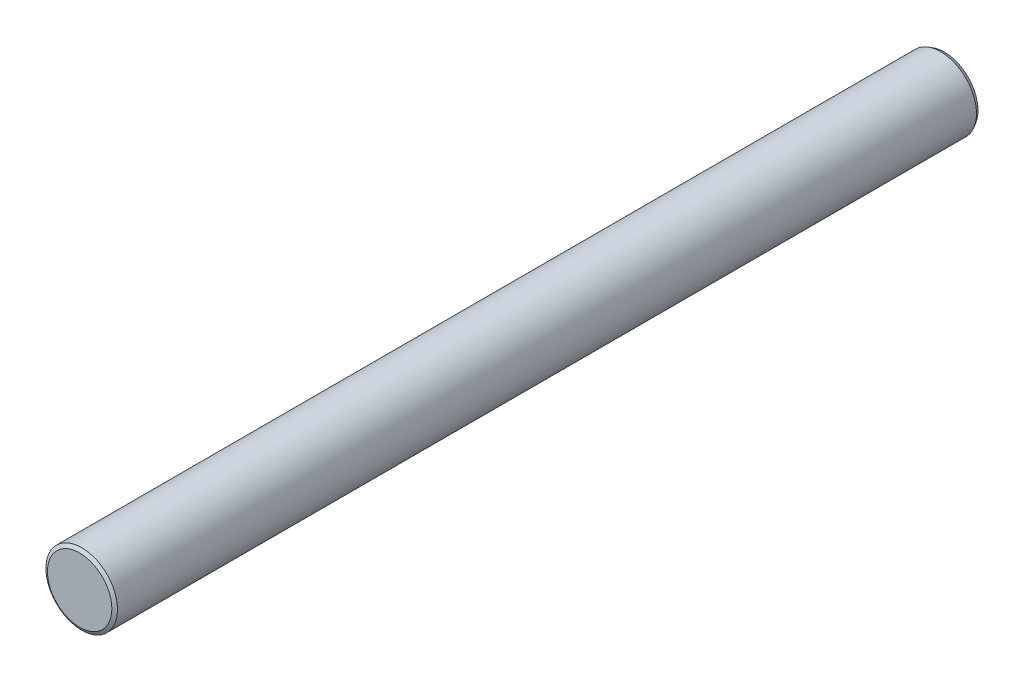
ISO-10303-21;
HEADER;
FILE_DESCRIPTION(('STEP AP214'),'2;1');
FILE_NAME('part.step','',(''),(''),'','','');
FILE_SCHEMA(('AUTOMOTIVE_DESIGN { 1 0 10303 214 1 1 1 1 }'));
ENDSEC;
DATA;
#1=APPLICATION_CONTEXT('core data for automotive mechanical design processes');
#2=APPLICATION_PROTOCOL_DEFINITION('international standard','automotive_design',2000,#1);
#3=PRODUCT_CONTEXT('',#1,'mechanical');
#4=PRODUCT('Part','Part','',(#3));
#5=PRODUCT_RELATED_PRODUCT_CATEGORY('part','',(#4));
#6=PRODUCT_DEFINITION_FORMATION('','',#4);
#7=PRODUCT_DEFINITION_CONTEXT('part definition',#1,'design');
#8=PRODUCT_DEFINITION('design','',#6,#7);
#9=PRODUCT_DEFINITION_SHAPE('','',#8);
#10=(LENGTH_UNIT() NAMED_UNIT(*) SI_UNIT(.MILLI.,.METRE.));
#11=(NAMED_UNIT(*) PLANE_ANGLE_UNIT() SI_UNIT($,.RADIAN.));
#12=(NAMED_UNIT(*) SI_UNIT($,.STERADIAN.) SOLID_ANGLE_UNIT());
#13=UNCERTAINTY_MEASURE_WITH_UNIT(LENGTH_MEASURE(1.E-05),#10,'distance_accuracy_value','');
#14=(GEOMETRIC_REPRESENTATION_CONTEXT(3) GLOBAL_UNCERTAINTY_ASSIGNED_CONTEXT((#13)) GLOBAL_UNIT_ASSIGNED_CONTEXT((#10,
#11,#12)) REPRESENTATION_CONTEXT('',''));
#15=CARTESIAN_POINT('',(0.,0.,0.));
#16=DIRECTION('',(0.,0.,1.));
#17=DIRECTION('',(1.,0.,0.));
#18=AXIS2_PLACEMENT_3D('',#15,#16,#17);
#19=CARTESIAN_POINT('',(0.,0.,42.));
#20=DIRECTION('',(0.,0.,-1.));
#21=DIRECTION('',(-1.,0.,0.));
#22=AXIS2_PLACEMENT_3D('',#19,#20,#21);
#23=CYLINDRICAL_SURFACE('',#22,3.475);
#24=CARTESIAN_POINT('',(0.,0.,-41.6535898384861));
#25=DIRECTION('',(0.,0.,1.));
#26=DIRECTION('',(1.,0.,0.));
#27=AXIS2_PLACEMENT_3D('',#24,#25,#26);
#28=CIRCLE('',#27,3.475);
#29=CARTESIAN_POINT('',(3.475,0.,-41.6535898384861));
#30=VERTEX_POINT('',#29);
#31=EDGE_CURVE('E53',#30,#30,#28,.T.);
#32=ORIENTED_EDGE('',*,*,#31,.T.);
#33=EDGE_LOOP('',(#32));
#34=FACE_BOUND('',#33,.T.);
#35=CARTESIAN_POINT('',(0.,0.,41.8));
#36=DIRECTION('',(0.,0.,1.));
#37=DIRECTION('',(1.,0.,0.));
#38=AXIS2_PLACEMENT_3D('',#35,#36,#37);
#39=CIRCLE('',#38,3.475);
#40=CARTESIAN_POINT('',(3.475,0.,41.8));
#41=VERTEX_POINT('',#40);
#42=EDGE_CURVE('E58',#41,#41,#39,.F.);
#43=ORIENTED_EDGE('',*,*,#42,.T.);
#44=EDGE_LOOP('',(#43));
#45=FACE_BOUND('',#44,.T.);
#46=ADVANCED_FACE('F39',(#34,#45),#23,.T.);
#47=CARTESIAN_POINT('',(0.,0.,42.));
#48=DIRECTION('',(0.,0.,1.));
#49=DIRECTION('',(1.,0.,0.));
#50=AXIS2_PLACEMENT_3D('',#47,#48,#49);
#51=PLANE('',#50);
#52=CARTESIAN_POINT('',(0.,0.,42.));
#53=DIRECTION('',(0.,0.,1.));
#54=DIRECTION('',(1.,0.,0.));
#55=AXIS2_PLACEMENT_3D('',#52,#53,#54);
#56=CIRCLE('',#55,3.12858983848624);
#57=CARTESIAN_POINT('',(3.12858983848624,0.,42.));
#58=VERTEX_POINT('',#57);
#59=EDGE_CURVE('E10',#58,#58,#56,.T.);
#60=ORIENTED_EDGE('',*,*,#59,.T.);
#61=EDGE_LOOP('',(#60));
#62=FACE_BOUND('',#61,.T.);
#63=ADVANCED_FACE('F75',(#62),#51,.T.);
#64=CARTESIAN_POINT('',(0.,0.,-42.));
#65=DIRECTION('',(0.,0.,1.));
#66=DIRECTION('',(1.,0.,0.));
#67=AXIS2_PLACEMENT_3D('',#64,#65,#66);
#68=PLANE('',#67);
#69=CARTESIAN_POINT('',(0.,0.,-42.));
#70=DIRECTION('',(0.,0.,1.));
#71=DIRECTION('',(1.,0.,0.));
#72=AXIS2_PLACEMENT_3D('',#69,#70,#71);
#73=CIRCLE('',#72,3.27499999999992);
#74=CARTESIAN_POINT('',(3.27499999999992,0.,-42.));
#75=VERTEX_POINT('',#74);
#76=EDGE_CURVE('E48',#75,#75,#73,.F.);
#77=ORIENTED_EDGE('',*,*,#76,.T.);
#78=EDGE_LOOP('',(#77));
#79=FACE_BOUND('',#78,.T.);
#80=ADVANCED_FACE('F72',(#79),#68,.F.);
#81=CARTESIAN_POINT('',(0.,0.,-41.6535898384861));
#82=DIRECTION('',(0.,0.,1.));
#83=DIRECTION('',(1.,0.,0.));
#84=AXIS2_PLACEMENT_3D('',#81,#82,#83);
#85=CONICAL_SURFACE('',#84,3.475,0.523598775598285);
#86=ORIENTED_EDGE('',*,*,#76,.F.);
#87=EDGE_LOOP('',(#86));
#88=FACE_BOUND('',#87,.T.);
#89=ORIENTED_EDGE('',*,*,#31,.F.);
#90=EDGE_LOOP('',(#89));
#91=FACE_BOUND('',#90,.T.);
#92=ADVANCED_FACE('F68',(#88,#91),#85,.T.);
#93=CARTESIAN_POINT('',(0.,0.,42.));
#94=DIRECTION('',(0.,0.,-1.));
#95=DIRECTION('',(-1.,0.,0.));
#96=AXIS2_PLACEMENT_3D('',#93,#94,#95);
#97=CONICAL_SURFACE('',#96,3.12858983848624,1.0471975511966);
#98=ORIENTED_EDGE('',*,*,#42,.F.);
#99=EDGE_LOOP('',(#98));
#100=FACE_BOUND('',#99,.T.);
#101=ORIENTED_EDGE('',*,*,#59,.F.);
#102=EDGE_LOOP('',(#101));
#103=FACE_BOUND('',#102,.T.);
#104=ADVANCED_FACE('F42',(#100,#103),#97,.T.);
#105=CLOSED_SHELL('',(#46,#63,#80,#92,#104));
#106=MANIFOLD_SOLID_BREP('B2',#105);
#107=ADVANCED_BREP_SHAPE_REPRESENTATION('',(#18,#106),#14);
#108=SHAPE_DEFINITION_REPRESENTATION(#9,#107);
ENDSEC;
END-ISO-10303-21;
